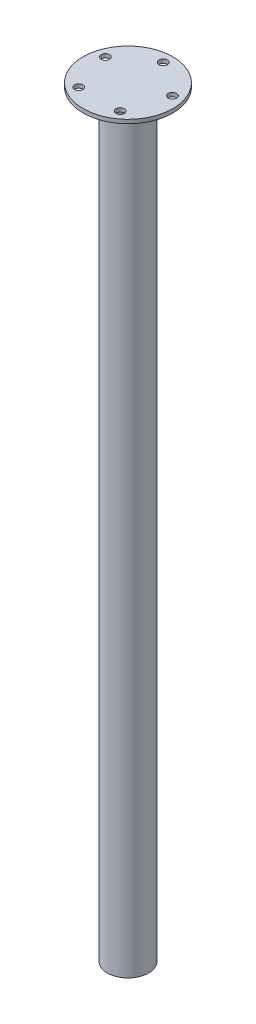
ISO-10303-21;
HEADER;
FILE_DESCRIPTION(('STEP AP214'),'2;1');
FILE_NAME('part.step','',(''),(''),'','','');
FILE_SCHEMA(('AUTOMOTIVE_DESIGN { 1 0 10303 214 1 1 1 1 }'));
ENDSEC;
DATA;
#1=APPLICATION_CONTEXT('core data for automotive mechanical design processes');
#2=APPLICATION_PROTOCOL_DEFINITION('international standard','automotive_design',2000,#1);
#3=PRODUCT_CONTEXT('',#1,'mechanical');
#4=PRODUCT('Part','Part','',(#3));
#5=PRODUCT_RELATED_PRODUCT_CATEGORY('part','',(#4));
#6=PRODUCT_DEFINITION_FORMATION('','',#4);
#7=PRODUCT_DEFINITION_CONTEXT('part definition',#1,'design');
#8=PRODUCT_DEFINITION('design','',#6,#7);
#9=PRODUCT_DEFINITION_SHAPE('','',#8);
#10=(LENGTH_UNIT() NAMED_UNIT(*) SI_UNIT(.MILLI.,.METRE.));
#11=(NAMED_UNIT(*) PLANE_ANGLE_UNIT() SI_UNIT($,.RADIAN.));
#12=(NAMED_UNIT(*) SI_UNIT($,.STERADIAN.) SOLID_ANGLE_UNIT());
#13=UNCERTAINTY_MEASURE_WITH_UNIT(LENGTH_MEASURE(1.E-05),#10,'distance_accuracy_value','');
#14=(GEOMETRIC_REPRESENTATION_CONTEXT(3) GLOBAL_UNCERTAINTY_ASSIGNED_CONTEXT((#13)) GLOBAL_UNIT_ASSIGNED_CONTEXT((#10,
#11,#12)) REPRESENTATION_CONTEXT('',''));
#15=CARTESIAN_POINT('',(0.,0.,0.));
#16=DIRECTION('',(0.,0.,1.));
#17=DIRECTION('',(1.,0.,0.));
#18=AXIS2_PLACEMENT_3D('',#15,#16,#17);
#19=CARTESIAN_POINT('',(0.,0.,0.));
#20=DIRECTION('',(0.,1.,0.));
#21=DIRECTION('',(0.,0.,1.));
#22=AXIS2_PLACEMENT_3D('',#19,#20,#21);
#23=PLANE('',#22);
#24=CARTESIAN_POINT('',(0.,0.,0.));
#25=DIRECTION('',(0.,1.,0.));
#26=DIRECTION('',(0.,0.,1.));
#27=AXIS2_PLACEMENT_3D('',#24,#25,#26);
#28=CIRCLE('',#27,16.);
#29=CARTESIAN_POINT('',(0.,0.,16.));
#30=VERTEX_POINT('',#29);
#31=EDGE_CURVE('E44',#30,#30,#28,.T.);
#32=ORIENTED_EDGE('',*,*,#31,.F.);
#33=EDGE_LOOP('',(#32));
#34=FACE_BOUND('',#33,.T.);
#35=CARTESIAN_POINT('',(0.,0.,0.));
#36=DIRECTION('',(0.,1.,0.));
#37=DIRECTION('',(0.,0.,1.));
#38=AXIS2_PLACEMENT_3D('',#35,#36,#37);
#39=CIRCLE('',#38,14.);
#40=CARTESIAN_POINT('',(0.,0.,14.));
#41=VERTEX_POINT('',#40);
#42=EDGE_CURVE('E77',#41,#41,#39,.T.);
#43=ORIENTED_EDGE('',*,*,#42,.T.);
#44=EDGE_LOOP('',(#43));
#45=FACE_BOUND('',#44,.T.);
#46=ADVANCED_FACE('F31',(#34,#45),#23,.F.);
#47=CARTESIAN_POINT('',(0.,590.,0.));
#48=DIRECTION('',(0.,-1.,0.));
#49=DIRECTION('',(0.,0.,-1.));
#50=AXIS2_PLACEMENT_3D('',#47,#48,#49);
#51=CYLINDRICAL_SURFACE('',#50,16.);
#52=CARTESIAN_POINT('',(0.,588.,0.));
#53=DIRECTION('',(0.,1.,0.));
#54=DIRECTION('',(0.,0.,1.));
#55=AXIS2_PLACEMENT_3D('',#52,#53,#54);
#56=CIRCLE('',#55,16.);
#57=CARTESIAN_POINT('',(0.,588.,16.));
#58=VERTEX_POINT('',#57);
#59=EDGE_CURVE('E10',#58,#58,#56,.F.);
#60=ORIENTED_EDGE('',*,*,#59,.T.);
#61=EDGE_LOOP('',(#60));
#62=FACE_BOUND('',#61,.T.);
#63=ORIENTED_EDGE('',*,*,#31,.T.);
#64=EDGE_LOOP('',(#63));
#65=FACE_BOUND('',#64,.T.);
#66=ADVANCED_FACE('F82',(#62,#65),#51,.T.);
#67=CARTESIAN_POINT('',(0.,590.,0.));
#68=DIRECTION('',(0.,-1.,0.));
#69=DIRECTION('',(0.,0.,-1.));
#70=AXIS2_PLACEMENT_3D('',#67,#68,#69);
#71=CYLINDRICAL_SURFACE('',#70,14.);
#72=CARTESIAN_POINT('',(0.,590.,0.));
#73=DIRECTION('',(0.,1.,0.));
#74=DIRECTION('',(0.,0.,1.));
#75=AXIS2_PLACEMENT_3D('',#72,#73,#74);
#76=CIRCLE('',#75,14.);
#77=CARTESIAN_POINT('',(0.,590.,14.));
#78=VERTEX_POINT('',#77);
#79=EDGE_CURVE('E71',#78,#78,#76,.T.);
#80=ORIENTED_EDGE('',*,*,#79,.T.);
#81=EDGE_LOOP('',(#80));
#82=FACE_BOUND('',#81,.T.);
#83=ORIENTED_EDGE('',*,*,#42,.F.);
#84=EDGE_LOOP('',(#83));
#85=FACE_BOUND('',#84,.T.);
#86=ADVANCED_FACE('F89',(#82,#85),#71,.F.);
#87=CARTESIAN_POINT('',(0.,590.,0.));
#88=DIRECTION('',(0.,1.,0.));
#89=DIRECTION('',(0.,0.,1.));
#90=AXIS2_PLACEMENT_3D('',#87,#88,#89);
#91=PLANE('',#90);
#92=ORIENTED_EDGE('',*,*,#79,.F.);
#93=EDGE_LOOP('',(#92));
#94=FACE_BOUND('',#93,.T.);
#95=ADVANCED_FACE('F91',(#94),#91,.F.);
#96=CARTESIAN_POINT('',(0.,593.,0.));
#97=DIRECTION('',(0.,-1.,0.));
#98=DIRECTION('',(0.,0.,-1.));
#99=AXIS2_PLACEMENT_3D('',#96,#97,#98);
#100=CYLINDRICAL_SURFACE('',#99,35.);
#101=CARTESIAN_POINT('',(0.,593.,0.));
#102=DIRECTION('',(0.,1.,0.));
#103=DIRECTION('',(0.,0.,1.));
#104=AXIS2_PLACEMENT_3D('',#101,#102,#103);
#105=CIRCLE('',#104,35.);
#106=CARTESIAN_POINT('',(0.,593.,35.));
#107=VERTEX_POINT('',#106);
#108=EDGE_CURVE('E66',#107,#107,#105,.T.);
#109=ORIENTED_EDGE('',*,*,#108,.F.);
#110=EDGE_LOOP('',(#109));
#111=FACE_BOUND('',#110,.T.);
#112=CARTESIAN_POINT('',(0.,590.,0.));
#113=DIRECTION('',(0.,1.,0.));
#114=DIRECTION('',(0.,0.,1.));
#115=AXIS2_PLACEMENT_3D('',#112,#113,#114);
#116=CIRCLE('',#115,35.);
#117=CARTESIAN_POINT('',(0.,590.,35.));
#118=VERTEX_POINT('',#117);
#119=EDGE_CURVE('E62',#118,#118,#116,.T.);
#120=ORIENTED_EDGE('',*,*,#119,.T.);
#121=EDGE_LOOP('',(#120));
#122=FACE_BOUND('',#121,.T.);
#123=ADVANCED_FACE('F98',(#111,#122),#100,.T.);
#124=CARTESIAN_POINT('',(0.,593.,0.));
#125=DIRECTION('',(0.,1.,0.));
#126=DIRECTION('',(0.,0.,1.));
#127=AXIS2_PLACEMENT_3D('',#124,#125,#126);
#128=PLANE('',#127);
#129=CARTESIAN_POINT('',(0.,593.,-27.5));
#130=DIRECTION('',(0.,1.,0.));
#131=DIRECTION('',(0.,0.,1.));
#132=AXIS2_PLACEMENT_3D('',#129,#130,#131);
#133=CIRCLE('',#132,3.25);
#134=CARTESIAN_POINT('',(0.,593.,-24.25));
#135=VERTEX_POINT('',#134);
#136=EDGE_CURVE('E52',#135,#135,#133,.T.);
#137=ORIENTED_EDGE('',*,*,#136,.F.);
#138=EDGE_LOOP('',(#137));
#139=FACE_BOUND('',#138,.T.);
#140=CARTESIAN_POINT('',(26.1540541981175,593.,-8.49796734531217));
#141=DIRECTION('',(0.,1.,0.));
#142=DIRECTION('',(0.,0.,1.));
#143=AXIS2_PLACEMENT_3D('',#140,#141,#142);
#144=CIRCLE('',#143,3.25000000000052);
#145=CARTESIAN_POINT('',(26.1540541981175,593.,-5.24796734531165));
#146=VERTEX_POINT('',#145);
#147=EDGE_CURVE('E135',#146,#146,#144,.T.);
#148=ORIENTED_EDGE('',*,*,#147,.F.);
#149=EDGE_LOOP('',(#148));
#150=FACE_BOUND('',#149,.T.);
#151=CARTESIAN_POINT('',(16.1640944380451,593.,22.2479673453104));
#152=DIRECTION('',(0.,1.,0.));
#153=DIRECTION('',(0.,0.,1.));
#154=AXIS2_PLACEMENT_3D('',#151,#152,#153);
#155=CIRCLE('',#154,3.25000000000197);
#156=CARTESIAN_POINT('',(16.1640944380451,593.,25.4979673453123));
#157=VERTEX_POINT('',#156);
#158=EDGE_CURVE('E138',#157,#157,#155,.T.);
#159=ORIENTED_EDGE('',*,*,#158,.F.);
#160=EDGE_LOOP('',(#159));
#161=FACE_BOUND('',#160,.T.);
#162=CARTESIAN_POINT('',(-16.1640944380409,593.,22.2479673453117));
#163=DIRECTION('',(0.,1.,0.));
#164=DIRECTION('',(0.,0.,1.));
#165=AXIS2_PLACEMENT_3D('',#162,#163,#164);
#166=CIRCLE('',#165,3.25000000000245);
#167=CARTESIAN_POINT('',(-16.1640944380409,593.,25.4979673453142));
#168=VERTEX_POINT('',#167);
#169=EDGE_CURVE('E143',#168,#168,#166,.T.);
#170=ORIENTED_EDGE('',*,*,#169,.F.);
#171=EDGE_LOOP('',(#170));
#172=FACE_BOUND('',#171,.T.);
#173=CARTESIAN_POINT('',(-26.1540541981159,593.,-8.49796734530994));
#174=DIRECTION('',(0.,1.,0.));
#175=DIRECTION('',(0.,0.,1.));
#176=AXIS2_PLACEMENT_3D('',#173,#174,#175);
#177=CIRCLE('',#176,3.2500000000014);
#178=CARTESIAN_POINT('',(-26.1540541981159,593.,-5.24796734530854));
#179=VERTEX_POINT('',#178);
#180=EDGE_CURVE('E145',#179,#179,#177,.T.);
#181=ORIENTED_EDGE('',*,*,#180,.F.);
#182=EDGE_LOOP('',(#181));
#183=FACE_BOUND('',#182,.T.);
#184=ORIENTED_EDGE('',*,*,#108,.T.);
#185=EDGE_LOOP('',(#184));
#186=FACE_BOUND('',#185,.T.);
#187=ADVANCED_FACE('F104',(#139,#150,#161,#172,#183,#186),#128,.T.);
#188=CARTESIAN_POINT('',(0.,590.,-27.5));
#189=DIRECTION('',(0.,1.,0.));
#190=DIRECTION('',(0.,0.,1.));
#191=AXIS2_PLACEMENT_3D('',#188,#189,#190);
#192=CIRCLE('',#191,3.25);
#193=CARTESIAN_POINT('',(0.,590.,-24.25));
#194=VERTEX_POINT('',#193);
#195=EDGE_CURVE('E35',#194,#194,#192,.T.);
#196=ORIENTED_EDGE('',*,*,#195,.T.);
#197=EDGE_LOOP('',(#196));
#198=FACE_BOUND('',#197,.T.);
#199=CARTESIAN_POINT('',(26.1540541981175,590.,-8.49796734531217));
#200=DIRECTION('',(0.,1.,0.));
#201=DIRECTION('',(0.,0.,1.));
#202=AXIS2_PLACEMENT_3D('',#199,#200,#201);
#203=CIRCLE('',#202,3.25000000000052);
#204=CARTESIAN_POINT('',(26.1540541981175,590.,-5.24796734531165));
#205=VERTEX_POINT('',#204);
#206=EDGE_CURVE('E57',#205,#205,#203,.T.);
#207=ORIENTED_EDGE('',*,*,#206,.T.);
#208=EDGE_LOOP('',(#207));
#209=FACE_BOUND('',#208,.T.);
#210=CARTESIAN_POINT('',(16.1640944380451,590.,22.2479673453104));
#211=DIRECTION('',(0.,1.,0.));
#212=DIRECTION('',(0.,0.,1.));
#213=AXIS2_PLACEMENT_3D('',#210,#211,#212);
#214=CIRCLE('',#213,3.25000000000197);
#215=CARTESIAN_POINT('',(16.1640944380451,590.,25.4979673453123));
#216=VERTEX_POINT('',#215);
#217=EDGE_CURVE('E55',#216,#216,#214,.T.);
#218=ORIENTED_EDGE('',*,*,#217,.T.);
#219=EDGE_LOOP('',(#218));
#220=FACE_BOUND('',#219,.T.);
#221=CARTESIAN_POINT('',(-16.1640944380409,590.,22.2479673453117));
#222=DIRECTION('',(0.,1.,0.));
#223=DIRECTION('',(0.,0.,1.));
#224=AXIS2_PLACEMENT_3D('',#221,#222,#223);
#225=CIRCLE('',#224,3.25000000000245);
#226=CARTESIAN_POINT('',(-16.1640944380409,590.,25.4979673453142));
#227=VERTEX_POINT('',#226);
#228=EDGE_CURVE('E51',#227,#227,#225,.T.);
#229=ORIENTED_EDGE('',*,*,#228,.T.);
#230=EDGE_LOOP('',(#229));
#231=FACE_BOUND('',#230,.T.);
#232=CARTESIAN_POINT('',(-26.1540541981159,590.,-8.49796734530994));
#233=DIRECTION('',(0.,1.,0.));
#234=DIRECTION('',(0.,0.,1.));
#235=AXIS2_PLACEMENT_3D('',#232,#233,#234);
#236=CIRCLE('',#235,3.2500000000014);
#237=CARTESIAN_POINT('',(-26.1540541981159,590.,-5.24796734530854));
#238=VERTEX_POINT('',#237);
#239=EDGE_CURVE('E48',#238,#238,#236,.T.);
#240=ORIENTED_EDGE('',*,*,#239,.T.);
#241=EDGE_LOOP('',(#240));
#242=FACE_BOUND('',#241,.T.);
#243=CARTESIAN_POINT('',(0.,590.,0.));
#244=DIRECTION('',(0.,1.,0.));
#245=DIRECTION('',(0.,0.,1.));
#246=AXIS2_PLACEMENT_3D('',#243,#244,#245);
#247=CIRCLE('',#246,18.);
#248=CARTESIAN_POINT('',(0.,590.,18.));
#249=VERTEX_POINT('',#248);
#250=EDGE_CURVE('E39',#249,#249,#247,.T.);
#251=ORIENTED_EDGE('',*,*,#250,.T.);
#252=EDGE_LOOP('',(#251));
#253=FACE_BOUND('',#252,.T.);
#254=ORIENTED_EDGE('',*,*,#119,.F.);
#255=EDGE_LOOP('',(#254));
#256=FACE_BOUND('',#255,.T.);
#257=ADVANCED_FACE('F101',(#198,#209,#220,#231,#242,#253,#256),#91,.F.);
#258=CARTESIAN_POINT('',(0.,590.,0.));
#259=DIRECTION('',(0.,1.,0.));
#260=DIRECTION('',(0.,0.,1.));
#261=AXIS2_PLACEMENT_3D('',#258,#259,#260);
#262=CONICAL_SURFACE('',#261,18.,0.785398163397424);
#263=ORIENTED_EDGE('',*,*,#59,.F.);
#264=EDGE_LOOP('',(#263));
#265=FACE_BOUND('',#264,.T.);
#266=ORIENTED_EDGE('',*,*,#250,.F.);
#267=EDGE_LOOP('',(#266));
#268=FACE_BOUND('',#267,.T.);
#269=ADVANCED_FACE('F33',(#265,#268),#262,.T.);
#270=CARTESIAN_POINT('',(-26.1540541981159,0.,-8.49796734530994));
#271=DIRECTION('',(0.,1.,0.));
#272=DIRECTION('',(0.,0.,1.));
#273=AXIS2_PLACEMENT_3D('',#270,#271,#272);
#274=CYLINDRICAL_SURFACE('',#273,3.2500000000014);
#275=ORIENTED_EDGE('',*,*,#180,.T.);
#276=EDGE_LOOP('',(#275));
#277=FACE_BOUND('',#276,.T.);
#278=ORIENTED_EDGE('',*,*,#239,.F.);
#279=EDGE_LOOP('',(#278));
#280=FACE_BOUND('',#279,.T.);
#281=ADVANCED_FACE('F111',(#277,#280),#274,.F.);
#282=CARTESIAN_POINT('',(-16.1640944380409,0.,22.2479673453117));
#283=DIRECTION('',(0.,1.,0.));
#284=DIRECTION('',(0.,0.,1.));
#285=AXIS2_PLACEMENT_3D('',#282,#283,#284);
#286=CYLINDRICAL_SURFACE('',#285,3.25000000000245);
#287=ORIENTED_EDGE('',*,*,#169,.T.);
#288=EDGE_LOOP('',(#287));
#289=FACE_BOUND('',#288,.T.);
#290=ORIENTED_EDGE('',*,*,#228,.F.);
#291=EDGE_LOOP('',(#290));
#292=FACE_BOUND('',#291,.T.);
#293=ADVANCED_FACE('F114',(#289,#292),#286,.F.);
#294=CARTESIAN_POINT('',(16.1640944380451,0.,22.2479673453104));
#295=DIRECTION('',(0.,1.,0.));
#296=DIRECTION('',(0.,0.,1.));
#297=AXIS2_PLACEMENT_3D('',#294,#295,#296);
#298=CYLINDRICAL_SURFACE('',#297,3.25000000000197);
#299=ORIENTED_EDGE('',*,*,#158,.T.);
#300=EDGE_LOOP('',(#299));
#301=FACE_BOUND('',#300,.T.);
#302=ORIENTED_EDGE('',*,*,#217,.F.);
#303=EDGE_LOOP('',(#302));
#304=FACE_BOUND('',#303,.T.);
#305=ADVANCED_FACE('F118',(#301,#304),#298,.F.);
#306=CARTESIAN_POINT('',(26.1540541981175,0.,-8.49796734531217));
#307=DIRECTION('',(0.,1.,0.));
#308=DIRECTION('',(0.,0.,1.));
#309=AXIS2_PLACEMENT_3D('',#306,#307,#308);
#310=CYLINDRICAL_SURFACE('',#309,3.25000000000052);
#311=ORIENTED_EDGE('',*,*,#147,.T.);
#312=EDGE_LOOP('',(#311));
#313=FACE_BOUND('',#312,.T.);
#314=ORIENTED_EDGE('',*,*,#206,.F.);
#315=EDGE_LOOP('',(#314));
#316=FACE_BOUND('',#315,.T.);
#317=ADVANCED_FACE('F122',(#313,#316),#310,.F.);
#318=CARTESIAN_POINT('',(0.,0.,-27.5));
#319=DIRECTION('',(0.,1.,0.));
#320=DIRECTION('',(0.,0.,1.));
#321=AXIS2_PLACEMENT_3D('',#318,#319,#320);
#322=CYLINDRICAL_SURFACE('',#321,3.25);
#323=ORIENTED_EDGE('',*,*,#136,.T.);
#324=EDGE_LOOP('',(#323));
#325=FACE_BOUND('',#324,.T.);
#326=ORIENTED_EDGE('',*,*,#195,.F.);
#327=EDGE_LOOP('',(#326));
#328=FACE_BOUND('',#327,.T.);
#329=ADVANCED_FACE('F126',(#325,#328),#322,.F.);
#330=CLOSED_SHELL('',(#46,#66,#86,#95,#123,#187,#257,#269,#281,#293,#305,#317,#329));
#331=MANIFOLD_SOLID_BREP('B2',#330);
#332=ADVANCED_BREP_SHAPE_REPRESENTATION('',(#18,#331),#14);
#333=SHAPE_DEFINITION_REPRESENTATION(#9,#332);
ENDSEC;
END-ISO-10303-21;
